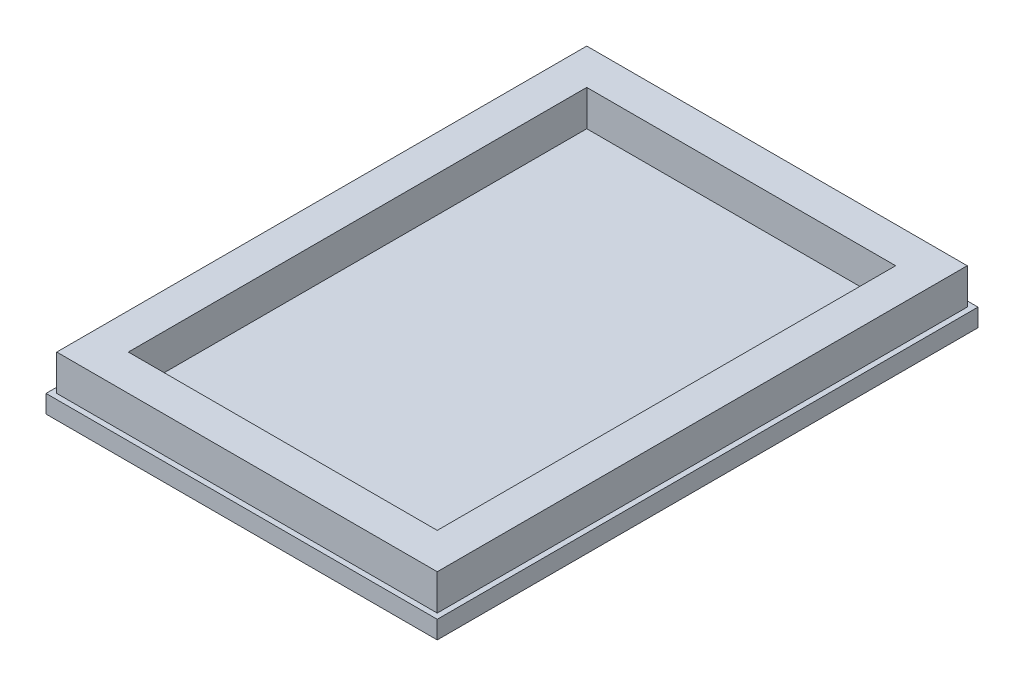
ISO-10303-21;
HEADER;
FILE_DESCRIPTION(('STEP AP214'),'2;1');
FILE_NAME('part.step','',(''),(''),'','','');
FILE_SCHEMA(('AUTOMOTIVE_DESIGN { 1 0 10303 214 1 1 1 1 }'));
ENDSEC;
DATA;
#1=APPLICATION_CONTEXT('core data for automotive mechanical design processes');
#2=APPLICATION_PROTOCOL_DEFINITION('international standard','automotive_design',2000,#1);
#3=PRODUCT_CONTEXT('',#1,'mechanical');
#4=PRODUCT('Part','Part','',(#3));
#5=PRODUCT_RELATED_PRODUCT_CATEGORY('part','',(#4));
#6=PRODUCT_DEFINITION_FORMATION('','',#4);
#7=PRODUCT_DEFINITION_CONTEXT('part definition',#1,'design');
#8=PRODUCT_DEFINITION('design','',#6,#7);
#9=PRODUCT_DEFINITION_SHAPE('','',#8);
#10=(LENGTH_UNIT() NAMED_UNIT(*) SI_UNIT(.MILLI.,.METRE.));
#11=(NAMED_UNIT(*) PLANE_ANGLE_UNIT() SI_UNIT($,.RADIAN.));
#12=(NAMED_UNIT(*) SI_UNIT($,.STERADIAN.) SOLID_ANGLE_UNIT());
#13=UNCERTAINTY_MEASURE_WITH_UNIT(LENGTH_MEASURE(1.E-05),#10,'distance_accuracy_value','');
#14=(GEOMETRIC_REPRESENTATION_CONTEXT(3) GLOBAL_UNCERTAINTY_ASSIGNED_CONTEXT((#13)) GLOBAL_UNIT_ASSIGNED_CONTEXT((#10,
#11,#12)) REPRESENTATION_CONTEXT('',''));
#15=CARTESIAN_POINT('',(0.,0.,0.));
#16=DIRECTION('',(0.,0.,1.));
#17=DIRECTION('',(1.,0.,0.));
#18=AXIS2_PLACEMENT_3D('',#15,#16,#17);
#19=CARTESIAN_POINT('',(0.,1.,0.));
#20=DIRECTION('',(0.,1.,0.));
#21=DIRECTION('',(0.,0.,1.));
#22=AXIS2_PLACEMENT_3D('',#19,#20,#21);
#23=PLANE('',#22);
#24=DIRECTION('',(0.,0.,-1.));
#25=VECTOR('',#24,1.);
#26=CARTESIAN_POINT('',(10.925,1.,-15.1));
#27=LINE('',#26,#25);
#28=CARTESIAN_POINT('',(10.925,1.,15.1));
#29=VERTEX_POINT('',#28);
#30=CARTESIAN_POINT('',(10.925,1.,-15.1));
#31=VERTEX_POINT('',#30);
#32=EDGE_CURVE('E189',#29,#31,#27,.T.);
#33=ORIENTED_EDGE('',*,*,#32,.T.);
#34=DIRECTION('',(-1.,0.,0.));
#35=VECTOR('',#34,1.);
#36=CARTESIAN_POINT('',(-10.925,1.,-15.1));
#37=LINE('',#36,#35);
#38=CARTESIAN_POINT('',(-10.925,1.,-15.1));
#39=VERTEX_POINT('',#38);
#40=EDGE_CURVE('E192',#31,#39,#37,.T.);
#41=ORIENTED_EDGE('',*,*,#40,.T.);
#42=DIRECTION('',(0.,0.,1.));
#43=VECTOR('',#42,1.);
#44=CARTESIAN_POINT('',(-10.925,1.,-15.1));
#45=LINE('',#44,#43);
#46=CARTESIAN_POINT('',(-10.925,1.,15.1));
#47=VERTEX_POINT('',#46);
#48=EDGE_CURVE('E195',#39,#47,#45,.T.);
#49=ORIENTED_EDGE('',*,*,#48,.T.);
#50=DIRECTION('',(1.,0.,0.));
#51=VECTOR('',#50,1.);
#52=CARTESIAN_POINT('',(-10.925,1.,15.1));
#53=LINE('',#52,#51);
#54=EDGE_CURVE('E197',#47,#29,#53,.T.);
#55=ORIENTED_EDGE('',*,*,#54,.T.);
#56=EDGE_LOOP('',(#33,#41,#49,#55));
#57=FACE_BOUND('',#56,.T.);
#58=DIRECTION('',(0.,0.,-1.));
#59=VECTOR('',#58,1.);
#60=CARTESIAN_POINT('',(10.625,1.,14.8));
#61=LINE('',#60,#59);
#62=CARTESIAN_POINT('',(10.625,1.,14.8));
#63=VERTEX_POINT('',#62);
#64=CARTESIAN_POINT('',(10.625,1.,-14.8));
#65=VERTEX_POINT('',#64);
#66=EDGE_CURVE('E175',#63,#65,#61,.T.);
#67=ORIENTED_EDGE('',*,*,#66,.F.);
#68=DIRECTION('',(1.,0.,0.));
#69=VECTOR('',#68,1.);
#70=CARTESIAN_POINT('',(-10.625,1.,14.8));
#71=LINE('',#70,#69);
#72=CARTESIAN_POINT('',(-10.625,1.,14.8));
#73=VERTEX_POINT('',#72);
#74=EDGE_CURVE('E140',#73,#63,#71,.T.);
#75=ORIENTED_EDGE('',*,*,#74,.F.);
#76=DIRECTION('',(0.,0.,1.));
#77=VECTOR('',#76,1.);
#78=CARTESIAN_POINT('',(-10.625,1.,-14.8));
#79=LINE('',#78,#77);
#80=CARTESIAN_POINT('',(-10.625,1.,-14.8));
#81=VERTEX_POINT('',#80);
#82=EDGE_CURVE('E166',#81,#73,#79,.T.);
#83=ORIENTED_EDGE('',*,*,#82,.F.);
#84=DIRECTION('',(-1.,0.,0.));
#85=VECTOR('',#84,1.);
#86=CARTESIAN_POINT('',(10.625,1.,-14.8));
#87=LINE('',#86,#85);
#88=EDGE_CURVE('E177',#65,#81,#87,.T.);
#89=ORIENTED_EDGE('',*,*,#88,.F.);
#90=EDGE_LOOP('',(#67,#75,#83,#89));
#91=FACE_BOUND('',#90,.T.);
#92=ADVANCED_FACE('F32',(#57,#91),#23,.T.);
#93=CARTESIAN_POINT('',(10.925,1.,-15.1));
#94=DIRECTION('',(-1.,0.,0.));
#95=DIRECTION('',(0.,0.,1.));
#96=AXIS2_PLACEMENT_3D('',#93,#94,#95);
#97=PLANE('',#96);
#98=DIRECTION('',(0.,0.,-1.));
#99=VECTOR('',#98,1.);
#100=CARTESIAN_POINT('',(10.925,0.,-15.1));
#101=LINE('',#100,#99);
#102=CARTESIAN_POINT('',(10.925,0.,15.1));
#103=VERTEX_POINT('',#102);
#104=CARTESIAN_POINT('',(10.925,0.,-15.1));
#105=VERTEX_POINT('',#104);
#106=EDGE_CURVE('E188',#103,#105,#101,.T.);
#107=ORIENTED_EDGE('',*,*,#106,.T.);
#108=DIRECTION('',(0.,-1.,0.));
#109=VECTOR('',#108,1.);
#110=CARTESIAN_POINT('',(10.925,1.,-15.1));
#111=LINE('',#110,#109);
#112=EDGE_CURVE('E11',#31,#105,#111,.T.);
#113=ORIENTED_EDGE('',*,*,#112,.F.);
#114=ORIENTED_EDGE('',*,*,#32,.F.);
#115=DIRECTION('',(0.,-1.,0.));
#116=VECTOR('',#115,1.);
#117=CARTESIAN_POINT('',(10.925,1.,15.1));
#118=LINE('',#117,#116);
#119=EDGE_CURVE('E199',#29,#103,#118,.T.);
#120=ORIENTED_EDGE('',*,*,#119,.T.);
#121=EDGE_LOOP('',(#107,#113,#114,#120));
#122=FACE_BOUND('',#121,.T.);
#123=ADVANCED_FACE('F34',(#122),#97,.F.);
#124=CARTESIAN_POINT('',(-10.925,1.,-15.1));
#125=DIRECTION('',(0.,0.,1.));
#126=DIRECTION('',(1.,0.,0.));
#127=AXIS2_PLACEMENT_3D('',#124,#125,#126);
#128=PLANE('',#127);
#129=DIRECTION('',(-1.,0.,0.));
#130=VECTOR('',#129,1.);
#131=CARTESIAN_POINT('',(-10.925,0.,-15.1));
#132=LINE('',#131,#130);
#133=CARTESIAN_POINT('',(-10.925,0.,-15.1));
#134=VERTEX_POINT('',#133);
#135=EDGE_CURVE('E202',#105,#134,#132,.T.);
#136=ORIENTED_EDGE('',*,*,#135,.T.);
#137=DIRECTION('',(0.,-1.,0.));
#138=VECTOR('',#137,1.);
#139=CARTESIAN_POINT('',(-10.925,1.,-15.1));
#140=LINE('',#139,#138);
#141=EDGE_CURVE('E40',#39,#134,#140,.T.);
#142=ORIENTED_EDGE('',*,*,#141,.F.);
#143=ORIENTED_EDGE('',*,*,#40,.F.);
#144=ORIENTED_EDGE('',*,*,#112,.T.);
#145=EDGE_LOOP('',(#136,#142,#143,#144));
#146=FACE_BOUND('',#145,.T.);
#147=ADVANCED_FACE('F232',(#146),#128,.F.);
#148=CARTESIAN_POINT('',(-10.925,1.,-15.1));
#149=DIRECTION('',(1.,0.,0.));
#150=DIRECTION('',(0.,0.,-1.));
#151=AXIS2_PLACEMENT_3D('',#148,#149,#150);
#152=PLANE('',#151);
#153=DIRECTION('',(0.,0.,1.));
#154=VECTOR('',#153,1.);
#155=CARTESIAN_POINT('',(-10.925,0.,-15.1));
#156=LINE('',#155,#154);
#157=CARTESIAN_POINT('',(-10.925,0.,15.1));
#158=VERTEX_POINT('',#157);
#159=EDGE_CURVE('E204',#134,#158,#156,.T.);
#160=ORIENTED_EDGE('',*,*,#159,.T.);
#161=DIRECTION('',(0.,-1.,0.));
#162=VECTOR('',#161,1.);
#163=CARTESIAN_POINT('',(-10.925,1.,15.1));
#164=LINE('',#163,#162);
#165=EDGE_CURVE('E209',#47,#158,#164,.T.);
#166=ORIENTED_EDGE('',*,*,#165,.F.);
#167=ORIENTED_EDGE('',*,*,#48,.F.);
#168=ORIENTED_EDGE('',*,*,#141,.T.);
#169=EDGE_LOOP('',(#160,#166,#167,#168));
#170=FACE_BOUND('',#169,.T.);
#171=ADVANCED_FACE('F216',(#170),#152,.F.);
#172=CARTESIAN_POINT('',(-10.925,1.,15.1));
#173=DIRECTION('',(0.,0.,-1.));
#174=DIRECTION('',(-1.,0.,0.));
#175=AXIS2_PLACEMENT_3D('',#172,#173,#174);
#176=PLANE('',#175);
#177=DIRECTION('',(1.,0.,0.));
#178=VECTOR('',#177,1.);
#179=CARTESIAN_POINT('',(-10.925,0.,15.1));
#180=LINE('',#179,#178);
#181=EDGE_CURVE('E193',#158,#103,#180,.T.);
#182=ORIENTED_EDGE('',*,*,#181,.T.);
#183=ORIENTED_EDGE('',*,*,#119,.F.);
#184=ORIENTED_EDGE('',*,*,#54,.F.);
#185=ORIENTED_EDGE('',*,*,#165,.T.);
#186=EDGE_LOOP('',(#182,#183,#184,#185));
#187=FACE_BOUND('',#186,.T.);
#188=ADVANCED_FACE('F225',(#187),#176,.F.);
#189=CARTESIAN_POINT('',(0.,0.,0.));
#190=DIRECTION('',(0.,1.,0.));
#191=DIRECTION('',(0.,0.,1.));
#192=AXIS2_PLACEMENT_3D('',#189,#190,#191);
#193=PLANE('',#192);
#194=ORIENTED_EDGE('',*,*,#106,.F.);
#195=ORIENTED_EDGE('',*,*,#181,.F.);
#196=ORIENTED_EDGE('',*,*,#159,.F.);
#197=ORIENTED_EDGE('',*,*,#135,.F.);
#198=EDGE_LOOP('',(#194,#195,#196,#197));
#199=FACE_BOUND('',#198,.T.);
#200=ADVANCED_FACE('F222',(#199),#193,.F.);
#201=CARTESIAN_POINT('',(0.,3.,0.));
#202=DIRECTION('',(0.,1.,0.));
#203=DIRECTION('',(0.,0.,1.));
#204=AXIS2_PLACEMENT_3D('',#201,#202,#203);
#205=PLANE('',#204);
#206=DIRECTION('',(1.,0.,0.));
#207=VECTOR('',#206,1.);
#208=CARTESIAN_POINT('',(-10.625,3.,14.8));
#209=LINE('',#208,#207);
#210=CARTESIAN_POINT('',(-10.625,3.,14.8));
#211=VERTEX_POINT('',#210);
#212=CARTESIAN_POINT('',(10.625,3.,14.8));
#213=VERTEX_POINT('',#212);
#214=EDGE_CURVE('E162',#211,#213,#209,.T.);
#215=ORIENTED_EDGE('',*,*,#214,.T.);
#216=DIRECTION('',(0.,0.,-1.));
#217=VECTOR('',#216,1.);
#218=CARTESIAN_POINT('',(10.625,3.,14.8));
#219=LINE('',#218,#217);
#220=CARTESIAN_POINT('',(10.625,3.,-14.8));
#221=VERTEX_POINT('',#220);
#222=EDGE_CURVE('E165',#213,#221,#219,.T.);
#223=ORIENTED_EDGE('',*,*,#222,.T.);
#224=DIRECTION('',(-1.,0.,0.));
#225=VECTOR('',#224,1.);
#226=CARTESIAN_POINT('',(10.625,3.,-14.8));
#227=LINE('',#226,#225);
#228=CARTESIAN_POINT('',(-10.625,3.,-14.8));
#229=VERTEX_POINT('',#228);
#230=EDGE_CURVE('E168',#221,#229,#227,.T.);
#231=ORIENTED_EDGE('',*,*,#230,.T.);
#232=DIRECTION('',(0.,0.,1.));
#233=VECTOR('',#232,1.);
#234=CARTESIAN_POINT('',(-10.625,3.,-14.8));
#235=LINE('',#234,#233);
#236=EDGE_CURVE('E170',#229,#211,#235,.T.);
#237=ORIENTED_EDGE('',*,*,#236,.T.);
#238=EDGE_LOOP('',(#215,#223,#231,#237));
#239=FACE_BOUND('',#238,.T.);
#240=DIRECTION('',(0.,0.,-1.));
#241=VECTOR('',#240,1.);
#242=CARTESIAN_POINT('',(8.625,3.,12.8));
#243=LINE('',#242,#241);
#244=CARTESIAN_POINT('',(8.625,3.,12.8));
#245=VERTEX_POINT('',#244);
#246=CARTESIAN_POINT('',(8.625,3.,-12.8));
#247=VERTEX_POINT('',#246);
#248=EDGE_CURVE('E132',#245,#247,#243,.T.);
#249=ORIENTED_EDGE('',*,*,#248,.F.);
#250=DIRECTION('',(1.,0.,0.));
#251=VECTOR('',#250,1.);
#252=CARTESIAN_POINT('',(-8.625,3.,12.8));
#253=LINE('',#252,#251);
#254=CARTESIAN_POINT('',(-8.625,3.,12.8));
#255=VERTEX_POINT('',#254);
#256=EDGE_CURVE('E123',#255,#245,#253,.T.);
#257=ORIENTED_EDGE('',*,*,#256,.F.);
#258=DIRECTION('',(0.,0.,1.));
#259=VECTOR('',#258,1.);
#260=CARTESIAN_POINT('',(-8.625,3.,-12.8));
#261=LINE('',#260,#259);
#262=CARTESIAN_POINT('',(-8.625,3.,-12.8));
#263=VERTEX_POINT('',#262);
#264=EDGE_CURVE('E148',#263,#255,#261,.T.);
#265=ORIENTED_EDGE('',*,*,#264,.F.);
#266=DIRECTION('',(-1.,0.,0.));
#267=VECTOR('',#266,1.);
#268=CARTESIAN_POINT('',(8.625,3.,-12.8));
#269=LINE('',#268,#267);
#270=EDGE_CURVE('E146',#247,#263,#269,.T.);
#271=ORIENTED_EDGE('',*,*,#270,.F.);
#272=EDGE_LOOP('',(#249,#257,#265,#271));
#273=FACE_BOUND('',#272,.T.);
#274=ADVANCED_FACE('F144',(#239,#273),#205,.T.);
#275=CARTESIAN_POINT('',(-10.625,3.,14.8));
#276=DIRECTION('',(0.,0.,-1.));
#277=DIRECTION('',(-1.,0.,0.));
#278=AXIS2_PLACEMENT_3D('',#275,#276,#277);
#279=PLANE('',#278);
#280=ORIENTED_EDGE('',*,*,#74,.T.);
#281=DIRECTION('',(0.,-1.,0.));
#282=VECTOR('',#281,1.);
#283=CARTESIAN_POINT('',(10.625,3.,14.8));
#284=LINE('',#283,#282);
#285=EDGE_CURVE('E186',#213,#63,#284,.T.);
#286=ORIENTED_EDGE('',*,*,#285,.F.);
#287=ORIENTED_EDGE('',*,*,#214,.F.);
#288=DIRECTION('',(0.,-1.,0.));
#289=VECTOR('',#288,1.);
#290=CARTESIAN_POINT('',(-10.625,3.,14.8));
#291=LINE('',#290,#289);
#292=EDGE_CURVE('E172',#211,#73,#291,.T.);
#293=ORIENTED_EDGE('',*,*,#292,.T.);
#294=EDGE_LOOP('',(#280,#286,#287,#293));
#295=FACE_BOUND('',#294,.T.);
#296=ADVANCED_FACE('F268',(#295),#279,.F.);
#297=CARTESIAN_POINT('',(10.625,3.,14.8));
#298=DIRECTION('',(-1.,0.,0.));
#299=DIRECTION('',(0.,0.,1.));
#300=AXIS2_PLACEMENT_3D('',#297,#298,#299);
#301=PLANE('',#300);
#302=ORIENTED_EDGE('',*,*,#66,.T.);
#303=DIRECTION('',(0.,-1.,0.));
#304=VECTOR('',#303,1.);
#305=CARTESIAN_POINT('',(10.625,3.,-14.8));
#306=LINE('',#305,#304);
#307=EDGE_CURVE('E183',#221,#65,#306,.T.);
#308=ORIENTED_EDGE('',*,*,#307,.F.);
#309=ORIENTED_EDGE('',*,*,#222,.F.);
#310=ORIENTED_EDGE('',*,*,#285,.T.);
#311=EDGE_LOOP('',(#302,#308,#309,#310));
#312=FACE_BOUND('',#311,.T.);
#313=ADVANCED_FACE('F275',(#312),#301,.F.);
#314=CARTESIAN_POINT('',(10.625,3.,-14.8));
#315=DIRECTION('',(0.,0.,1.));
#316=DIRECTION('',(1.,0.,0.));
#317=AXIS2_PLACEMENT_3D('',#314,#315,#316);
#318=PLANE('',#317);
#319=ORIENTED_EDGE('',*,*,#88,.T.);
#320=DIRECTION('',(0.,-1.,0.));
#321=VECTOR('',#320,1.);
#322=CARTESIAN_POINT('',(-10.625,3.,-14.8));
#323=LINE('',#322,#321);
#324=EDGE_CURVE('E47',#229,#81,#323,.T.);
#325=ORIENTED_EDGE('',*,*,#324,.F.);
#326=ORIENTED_EDGE('',*,*,#230,.F.);
#327=ORIENTED_EDGE('',*,*,#307,.T.);
#328=EDGE_LOOP('',(#319,#325,#326,#327));
#329=FACE_BOUND('',#328,.T.);
#330=ADVANCED_FACE('F272',(#329),#318,.F.);
#331=CARTESIAN_POINT('',(-10.625,3.,-14.8));
#332=DIRECTION('',(1.,0.,0.));
#333=DIRECTION('',(0.,0.,-1.));
#334=AXIS2_PLACEMENT_3D('',#331,#332,#333);
#335=PLANE('',#334);
#336=ORIENTED_EDGE('',*,*,#82,.T.);
#337=ORIENTED_EDGE('',*,*,#292,.F.);
#338=ORIENTED_EDGE('',*,*,#236,.F.);
#339=ORIENTED_EDGE('',*,*,#324,.T.);
#340=EDGE_LOOP('',(#336,#337,#338,#339));
#341=FACE_BOUND('',#340,.T.);
#342=ADVANCED_FACE('F265',(#341),#335,.F.);
#343=CARTESIAN_POINT('',(-8.625,3.,12.8));
#344=DIRECTION('',(0.,0.,-1.));
#345=DIRECTION('',(-1.,0.,0.));
#346=AXIS2_PLACEMENT_3D('',#343,#344,#345);
#347=PLANE('',#346);
#348=DIRECTION('',(1.,0.,0.));
#349=VECTOR('',#348,1.);
#350=CARTESIAN_POINT('',(-8.625,1.,12.8));
#351=LINE('',#350,#349);
#352=CARTESIAN_POINT('',(-8.625,1.,12.8));
#353=VERTEX_POINT('',#352);
#354=CARTESIAN_POINT('',(8.625,1.,12.8));
#355=VERTEX_POINT('',#354);
#356=EDGE_CURVE('E55',#353,#355,#351,.T.);
#357=ORIENTED_EDGE('',*,*,#356,.F.);
#358=DIRECTION('',(0.,-1.,0.));
#359=VECTOR('',#358,1.);
#360=CARTESIAN_POINT('',(-8.625,3.,12.8));
#361=LINE('',#360,#359);
#362=EDGE_CURVE('E128',#255,#353,#361,.T.);
#363=ORIENTED_EDGE('',*,*,#362,.F.);
#364=ORIENTED_EDGE('',*,*,#256,.T.);
#365=DIRECTION('',(0.,-1.,0.));
#366=VECTOR('',#365,1.);
#367=CARTESIAN_POINT('',(8.625,3.,12.8));
#368=LINE('',#367,#366);
#369=EDGE_CURVE('E126',#245,#355,#368,.T.);
#370=ORIENTED_EDGE('',*,*,#369,.T.);
#371=EDGE_LOOP('',(#357,#363,#364,#370));
#372=FACE_BOUND('',#371,.T.);
#373=ADVANCED_FACE('F125',(#372),#347,.T.);
#374=CARTESIAN_POINT('',(8.625,3.,12.8));
#375=DIRECTION('',(-1.,0.,0.));
#376=DIRECTION('',(0.,0.,1.));
#377=AXIS2_PLACEMENT_3D('',#374,#375,#376);
#378=PLANE('',#377);
#379=DIRECTION('',(0.,0.,-1.));
#380=VECTOR('',#379,1.);
#381=CARTESIAN_POINT('',(8.625,1.,12.8));
#382=LINE('',#381,#380);
#383=CARTESIAN_POINT('',(8.625,1.,-12.8));
#384=VERTEX_POINT('',#383);
#385=EDGE_CURVE('E139',#355,#384,#382,.T.);
#386=ORIENTED_EDGE('',*,*,#385,.F.);
#387=ORIENTED_EDGE('',*,*,#369,.F.);
#388=ORIENTED_EDGE('',*,*,#248,.T.);
#389=DIRECTION('',(0.,-1.,0.));
#390=VECTOR('',#389,1.);
#391=CARTESIAN_POINT('',(8.625,3.,-12.8));
#392=LINE('',#391,#390);
#393=EDGE_CURVE('E141',#247,#384,#392,.T.);
#394=ORIENTED_EDGE('',*,*,#393,.T.);
#395=EDGE_LOOP('',(#386,#387,#388,#394));
#396=FACE_BOUND('',#395,.T.);
#397=ADVANCED_FACE('F136',(#396),#378,.T.);
#398=CARTESIAN_POINT('',(8.625,3.,-12.8));
#399=DIRECTION('',(0.,0.,1.));
#400=DIRECTION('',(1.,0.,0.));
#401=AXIS2_PLACEMENT_3D('',#398,#399,#400);
#402=PLANE('',#401);
#403=DIRECTION('',(-1.,0.,0.));
#404=VECTOR('',#403,1.);
#405=CARTESIAN_POINT('',(8.625,1.,-12.8));
#406=LINE('',#405,#404);
#407=CARTESIAN_POINT('',(-8.625,1.,-12.8));
#408=VERTEX_POINT('',#407);
#409=EDGE_CURVE('E154',#384,#408,#406,.T.);
#410=ORIENTED_EDGE('',*,*,#409,.F.);
#411=ORIENTED_EDGE('',*,*,#393,.F.);
#412=ORIENTED_EDGE('',*,*,#270,.T.);
#413=DIRECTION('',(0.,-1.,0.));
#414=VECTOR('',#413,1.);
#415=CARTESIAN_POINT('',(-8.625,3.,-12.8));
#416=LINE('',#415,#414);
#417=EDGE_CURVE('E158',#263,#408,#416,.T.);
#418=ORIENTED_EDGE('',*,*,#417,.T.);
#419=EDGE_LOOP('',(#410,#411,#412,#418));
#420=FACE_BOUND('',#419,.T.);
#421=ADVANCED_FACE('F251',(#420),#402,.T.);
#422=CARTESIAN_POINT('',(-8.625,3.,-12.8));
#423=DIRECTION('',(1.,0.,0.));
#424=DIRECTION('',(0.,0.,-1.));
#425=AXIS2_PLACEMENT_3D('',#422,#423,#424);
#426=PLANE('',#425);
#427=DIRECTION('',(0.,0.,1.));
#428=VECTOR('',#427,1.);
#429=CARTESIAN_POINT('',(-8.625,1.,-12.8));
#430=LINE('',#429,#428);
#431=EDGE_CURVE('E133',#408,#353,#430,.T.);
#432=ORIENTED_EDGE('',*,*,#431,.F.);
#433=ORIENTED_EDGE('',*,*,#417,.F.);
#434=ORIENTED_EDGE('',*,*,#264,.T.);
#435=ORIENTED_EDGE('',*,*,#362,.T.);
#436=EDGE_LOOP('',(#432,#433,#434,#435));
#437=FACE_BOUND('',#436,.T.);
#438=ADVANCED_FACE('F247',(#437),#426,.T.);
#439=ORIENTED_EDGE('',*,*,#356,.T.);
#440=ORIENTED_EDGE('',*,*,#385,.T.);
#441=ORIENTED_EDGE('',*,*,#409,.T.);
#442=ORIENTED_EDGE('',*,*,#431,.T.);
#443=EDGE_LOOP('',(#439,#440,#441,#442));
#444=FACE_BOUND('',#443,.T.);
#445=ADVANCED_FACE('F241',(#444),#23,.T.);
#446=CLOSED_SHELL('',(#92,#123,#147,#171,#188,#200,#274,#296,#313,#330,#342,#373,#397,#421,#438,#445));
#447=MANIFOLD_SOLID_BREP('B2',#446);
#448=ADVANCED_BREP_SHAPE_REPRESENTATION('',(#18,#447),#14);
#449=SHAPE_DEFINITION_REPRESENTATION(#9,#448);
ENDSEC;
END-ISO-10303-21;
